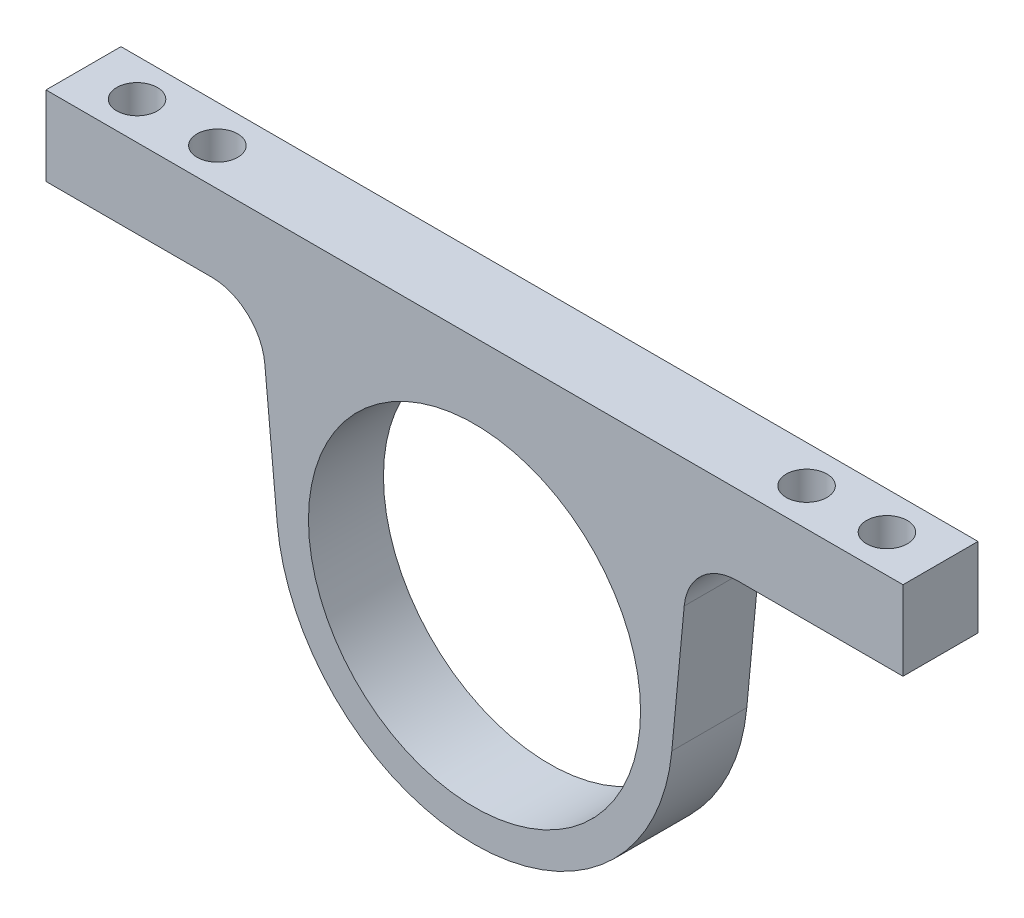
ISO-10303-21;
HEADER;
FILE_DESCRIPTION(('STEP AP214'),'2;1');
FILE_NAME('part.step','',(''),(''),'','','');
FILE_SCHEMA(('AUTOMOTIVE_DESIGN { 1 0 10303 214 1 1 1 1 }'));
ENDSEC;
DATA;
#1=APPLICATION_CONTEXT('core data for automotive mechanical design processes');
#2=APPLICATION_PROTOCOL_DEFINITION('international standard','automotive_design',2000,#1);
#3=PRODUCT_CONTEXT('',#1,'mechanical');
#4=PRODUCT('Part','Part','',(#3));
#5=PRODUCT_RELATED_PRODUCT_CATEGORY('part','',(#4));
#6=PRODUCT_DEFINITION_FORMATION('','',#4);
#7=PRODUCT_DEFINITION_CONTEXT('part definition',#1,'design');
#8=PRODUCT_DEFINITION('design','',#6,#7);
#9=PRODUCT_DEFINITION_SHAPE('','',#8);
#10=(LENGTH_UNIT() NAMED_UNIT(*) SI_UNIT(.MILLI.,.METRE.));
#11=(NAMED_UNIT(*) PLANE_ANGLE_UNIT() SI_UNIT($,.RADIAN.));
#12=(NAMED_UNIT(*) SI_UNIT($,.STERADIAN.) SOLID_ANGLE_UNIT());
#13=UNCERTAINTY_MEASURE_WITH_UNIT(LENGTH_MEASURE(1.E-05),#10,'distance_accuracy_value','');
#14=(GEOMETRIC_REPRESENTATION_CONTEXT(3) GLOBAL_UNCERTAINTY_ASSIGNED_CONTEXT((#13)) GLOBAL_UNIT_ASSIGNED_CONTEXT((#10,
#11,#12)) REPRESENTATION_CONTEXT('',''));
#15=CARTESIAN_POINT('',(0.,0.,0.));
#16=DIRECTION('',(0.,0.,1.));
#17=DIRECTION('',(1.,0.,0.));
#18=AXIS2_PLACEMENT_3D('',#15,#16,#17);
#19=CARTESIAN_POINT('',(-36.8377305404709,-3.46144603130801,7.));
#20=DIRECTION('',(0.995614338931646,0.093552595440757,0.));
#21=DIRECTION('',(-0.093552595440757,0.995614338931646,0.));
#22=AXIS2_PLACEMENT_3D('',#19,#20,#21);
#23=PLANE('',#22);
#24=DIRECTION('',(0.0935525954407569,-0.995614338931646,0.));
#25=VECTOR('',#24,1.);
#26=CARTESIAN_POINT('',(-36.8377305404709,-3.46144603130801,7.));
#27=LINE('',#26,#25);
#28=CARTESIAN_POINT('',(-39.1482594814971,21.1278850648986,7.));
#29=VERTEX_POINT('',#28);
#30=CARTESIAN_POINT('',(-36.8377305404709,-3.46144603130801,7.));
#31=VERTEX_POINT('',#30);
#32=EDGE_CURVE('E122',#29,#31,#27,.T.);
#33=ORIENTED_EDGE('',*,*,#32,.F.);
#34=DIRECTION('',(0.,0.,-1.));
#35=VECTOR('',#34,1.);
#36=CARTESIAN_POINT('',(-39.1482594814971,21.1278850648986,-7.));
#37=LINE('',#36,#35);
#38=CARTESIAN_POINT('',(-39.1482594814971,21.1278850648986,-7.));
#39=VERTEX_POINT('',#38);
#40=EDGE_CURVE('E163',#29,#39,#37,.T.);
#41=ORIENTED_EDGE('',*,*,#40,.T.);
#42=DIRECTION('',(0.0935525954407569,-0.995614338931646,0.));
#43=VECTOR('',#42,1.);
#44=CARTESIAN_POINT('',(-36.8377305404709,-3.46144603130801,-7.));
#45=LINE('',#44,#43);
#46=CARTESIAN_POINT('',(-36.8377305404709,-3.46144603130801,-7.));
#47=VERTEX_POINT('',#46);
#48=EDGE_CURVE('E147',#39,#47,#45,.T.);
#49=ORIENTED_EDGE('',*,*,#48,.T.);
#50=DIRECTION('',(0.,0.,-1.));
#51=VECTOR('',#50,1.);
#52=CARTESIAN_POINT('',(-36.8377305404709,-3.46144603130801,7.));
#53=LINE('',#52,#51);
#54=EDGE_CURVE('E141',#31,#47,#53,.T.);
#55=ORIENTED_EDGE('',*,*,#54,.F.);
#56=EDGE_LOOP('',(#33,#41,#49,#55));
#57=FACE_BOUND('',#56,.T.);
#58=ADVANCED_FACE('F43',(#57),#23,.F.);
#59=CARTESIAN_POINT('',(0.,0.,7.));
#60=DIRECTION('',(0.,0.,-1.));
#61=DIRECTION('',(-1.,0.,0.));
#62=AXIS2_PLACEMENT_3D('',#59,#60,#61);
#63=CYLINDRICAL_SURFACE('',#62,37.);
#64=CARTESIAN_POINT('',(0.,0.,-7.));
#65=DIRECTION('',(0.,0.,1.));
#66=DIRECTION('',(1.,0.,0.));
#67=AXIS2_PLACEMENT_3D('',#64,#65,#66);
#68=CIRCLE('',#67,37.);
#69=CARTESIAN_POINT('',(36.8377305404709,-3.46144603130801,-7.));
#70=VERTEX_POINT('',#69);
#71=EDGE_CURVE('E201',#47,#70,#68,.T.);
#72=ORIENTED_EDGE('',*,*,#71,.T.);
#73=DIRECTION('',(0.,0.,-1.));
#74=VECTOR('',#73,1.);
#75=CARTESIAN_POINT('',(36.8377305404709,-3.46144603130801,7.));
#76=LINE('',#75,#74);
#77=CARTESIAN_POINT('',(36.8377305404709,-3.46144603130801,7.));
#78=VERTEX_POINT('',#77);
#79=EDGE_CURVE('E143',#78,#70,#76,.T.);
#80=ORIENTED_EDGE('',*,*,#79,.F.);
#81=CARTESIAN_POINT('',(0.,0.,7.));
#82=DIRECTION('',(0.,0.,1.));
#83=DIRECTION('',(1.,0.,0.));
#84=AXIS2_PLACEMENT_3D('',#81,#82,#83);
#85=CIRCLE('',#84,37.);
#86=EDGE_CURVE('E127',#31,#78,#85,.T.);
#87=ORIENTED_EDGE('',*,*,#86,.F.);
#88=ORIENTED_EDGE('',*,*,#54,.T.);
#89=EDGE_LOOP('',(#72,#80,#87,#88));
#90=FACE_BOUND('',#89,.T.);
#91=ADVANCED_FACE('F140',(#90),#63,.T.);
#92=CARTESIAN_POINT('',(36.8377305404709,-3.46144603130801,7.));
#93=DIRECTION('',(0.995614338931646,-0.093552595440757,0.));
#94=DIRECTION('',(0.093552595440757,0.995614338931646,0.));
#95=AXIS2_PLACEMENT_3D('',#92,#93,#94);
#96=PLANE('',#95);
#97=DIRECTION('',(-0.0935525954407569,-0.995614338931646,0.));
#98=VECTOR('',#97,1.);
#99=CARTESIAN_POINT('',(36.8377305404709,-3.46144603130801,-7.));
#100=LINE('',#99,#98);
#101=CARTESIAN_POINT('',(39.1482594814971,21.1278850648986,-7.));
#102=VERTEX_POINT('',#101);
#103=EDGE_CURVE('E195',#102,#70,#100,.T.);
#104=ORIENTED_EDGE('',*,*,#103,.F.);
#105=DIRECTION('',(0.,0.,-1.));
#106=VECTOR('',#105,1.);
#107=CARTESIAN_POINT('',(39.1482594814971,21.1278850648986,7.));
#108=LINE('',#107,#106);
#109=CARTESIAN_POINT('',(39.1482594814971,21.1278850648986,7.));
#110=VERTEX_POINT('',#109);
#111=EDGE_CURVE('E155',#102,#110,#108,.F.);
#112=ORIENTED_EDGE('',*,*,#111,.T.);
#113=DIRECTION('',(-0.0935525954407569,-0.995614338931646,0.));
#114=VECTOR('',#113,1.);
#115=CARTESIAN_POINT('',(36.8377305404709,-3.46144603130801,7.));
#116=LINE('',#115,#114);
#117=EDGE_CURVE('E145',#110,#78,#116,.T.);
#118=ORIENTED_EDGE('',*,*,#117,.T.);
#119=ORIENTED_EDGE('',*,*,#79,.T.);
#120=EDGE_LOOP('',(#104,#112,#118,#119));
#121=FACE_BOUND('',#120,.T.);
#122=ADVANCED_FACE('F199',(#121),#96,.T.);
#123=CARTESIAN_POINT('',(0.,30.1923591104911,7.));
#124=DIRECTION('',(0.,-1.,0.));
#125=DIRECTION('',(1.,0.,0.));
#126=AXIS2_PLACEMENT_3D('',#123,#124,#125);
#127=PLANE('',#126);
#128=CARTESIAN_POINT('',(70.,30.1923591104911,0.));
#129=DIRECTION('',(0.,-1.,0.));
#130=DIRECTION('',(1.,0.,0.));
#131=AXIS2_PLACEMENT_3D('',#128,#129,#130);
#132=CIRCLE('',#131,3.8);
#133=CARTESIAN_POINT('',(73.8,30.1923591104911,0.));
#134=VERTEX_POINT('',#133);
#135=EDGE_CURVE('E286',#134,#134,#132,.T.);
#136=ORIENTED_EDGE('',*,*,#135,.F.);
#137=EDGE_LOOP('',(#136));
#138=FACE_BOUND('',#137,.T.);
#139=CARTESIAN_POINT('',(55.,30.1923591104911,0.));
#140=DIRECTION('',(0.,-1.,0.));
#141=DIRECTION('',(1.,0.,0.));
#142=AXIS2_PLACEMENT_3D('',#139,#140,#141);
#143=CIRCLE('',#142,3.8);
#144=CARTESIAN_POINT('',(58.8,30.1923591104911,0.));
#145=VERTEX_POINT('',#144);
#146=EDGE_CURVE('E278',#145,#145,#143,.T.);
#147=ORIENTED_EDGE('',*,*,#146,.F.);
#148=EDGE_LOOP('',(#147));
#149=FACE_BOUND('',#148,.T.);
#150=DIRECTION('',(-1.,0.,0.));
#151=VECTOR('',#150,1.);
#152=CARTESIAN_POINT('',(0.,30.1923591104911,7.));
#153=LINE('',#152,#151);
#154=CARTESIAN_POINT('',(80.,30.1923591104911,7.));
#155=VERTEX_POINT('',#154);
#156=CARTESIAN_POINT('',(49.1044028708136,30.1923591104911,7.));
#157=VERTEX_POINT('',#156);
#158=EDGE_CURVE('E179',#155,#157,#153,.T.);
#159=ORIENTED_EDGE('',*,*,#158,.T.);
#160=DIRECTION('',(0.,0.,-1.));
#161=VECTOR('',#160,1.);
#162=CARTESIAN_POINT('',(49.1044028708136,30.1923591104911,-7.));
#163=LINE('',#162,#161);
#164=CARTESIAN_POINT('',(49.1044028708136,30.1923591104911,-7.));
#165=VERTEX_POINT('',#164);
#166=EDGE_CURVE('E150',#157,#165,#163,.T.);
#167=ORIENTED_EDGE('',*,*,#166,.T.);
#168=DIRECTION('',(-1.,0.,0.));
#169=VECTOR('',#168,1.);
#170=CARTESIAN_POINT('',(0.,30.1923591104911,-7.));
#171=LINE('',#170,#169);
#172=CARTESIAN_POINT('',(80.,30.1923591104911,-7.));
#173=VERTEX_POINT('',#172);
#174=EDGE_CURVE('E197',#173,#165,#171,.T.);
#175=ORIENTED_EDGE('',*,*,#174,.F.);
#176=DIRECTION('',(0.,0.,-1.));
#177=VECTOR('',#176,1.);
#178=CARTESIAN_POINT('',(80.,30.1923591104911,7.));
#179=LINE('',#178,#177);
#180=EDGE_CURVE('E157',#155,#173,#179,.T.);
#181=ORIENTED_EDGE('',*,*,#180,.F.);
#182=EDGE_LOOP('',(#159,#167,#175,#181));
#183=FACE_BOUND('',#182,.T.);
#184=ADVANCED_FACE('F185',(#138,#149,#183),#127,.T.);
#185=CARTESIAN_POINT('',(80.,0.,7.));
#186=DIRECTION('',(1.,0.,0.));
#187=DIRECTION('',(0.,0.,-1.));
#188=AXIS2_PLACEMENT_3D('',#185,#186,#187);
#189=PLANE('',#188);
#190=DIRECTION('',(0.,-1.,0.));
#191=VECTOR('',#190,1.);
#192=CARTESIAN_POINT('',(80.,0.,-7.));
#193=LINE('',#192,#191);
#194=CARTESIAN_POINT('',(80.,45.,-7.));
#195=VERTEX_POINT('',#194);
#196=EDGE_CURVE('E205',#195,#173,#193,.T.);
#197=ORIENTED_EDGE('',*,*,#196,.F.);
#198=DIRECTION('',(0.,0.,-1.));
#199=VECTOR('',#198,1.);
#200=CARTESIAN_POINT('',(80.,45.,7.));
#201=LINE('',#200,#199);
#202=CARTESIAN_POINT('',(80.,45.,7.));
#203=VERTEX_POINT('',#202);
#204=EDGE_CURVE('E233',#203,#195,#201,.T.);
#205=ORIENTED_EDGE('',*,*,#204,.F.);
#206=DIRECTION('',(0.,-1.,0.));
#207=VECTOR('',#206,1.);
#208=CARTESIAN_POINT('',(80.,0.,7.));
#209=LINE('',#208,#207);
#210=EDGE_CURVE('E189',#203,#155,#209,.T.);
#211=ORIENTED_EDGE('',*,*,#210,.T.);
#212=ORIENTED_EDGE('',*,*,#180,.T.);
#213=EDGE_LOOP('',(#197,#205,#211,#212));
#214=FACE_BOUND('',#213,.T.);
#215=ADVANCED_FACE('F238',(#214),#189,.T.);
#216=CARTESIAN_POINT('',(0.,45.,7.));
#217=DIRECTION('',(0.,1.,0.));
#218=DIRECTION('',(0.,0.,1.));
#219=AXIS2_PLACEMENT_3D('',#216,#217,#218);
#220=PLANE('',#219);
#221=CARTESIAN_POINT('',(70.,45.,0.));
#222=DIRECTION('',(0.,1.,0.));
#223=DIRECTION('',(0.,0.,1.));
#224=AXIS2_PLACEMENT_3D('',#221,#222,#223);
#225=CIRCLE('',#224,3.8);
#226=CARTESIAN_POINT('',(70.,45.,3.8));
#227=VERTEX_POINT('',#226);
#228=EDGE_CURVE('E290',#227,#227,#225,.T.);
#229=ORIENTED_EDGE('',*,*,#228,.F.);
#230=EDGE_LOOP('',(#229));
#231=FACE_BOUND('',#230,.T.);
#232=CARTESIAN_POINT('',(55.,45.,0.));
#233=DIRECTION('',(0.,1.,0.));
#234=DIRECTION('',(0.,0.,1.));
#235=AXIS2_PLACEMENT_3D('',#232,#233,#234);
#236=CIRCLE('',#235,3.8);
#237=CARTESIAN_POINT('',(55.,45.,3.8));
#238=VERTEX_POINT('',#237);
#239=EDGE_CURVE('E282',#238,#238,#236,.T.);
#240=ORIENTED_EDGE('',*,*,#239,.F.);
#241=EDGE_LOOP('',(#240));
#242=FACE_BOUND('',#241,.T.);
#243=CARTESIAN_POINT('',(-70.,45.,0.));
#244=DIRECTION('',(0.,1.,0.));
#245=DIRECTION('',(0.,0.,1.));
#246=AXIS2_PLACEMENT_3D('',#243,#244,#245);
#247=CIRCLE('',#246,3.8);
#248=CARTESIAN_POINT('',(-70.,45.,3.8));
#249=VERTEX_POINT('',#248);
#250=EDGE_CURVE('E274',#249,#249,#247,.T.);
#251=ORIENTED_EDGE('',*,*,#250,.F.);
#252=EDGE_LOOP('',(#251));
#253=FACE_BOUND('',#252,.T.);
#254=CARTESIAN_POINT('',(-55.,45.,0.));
#255=DIRECTION('',(0.,1.,0.));
#256=DIRECTION('',(0.,0.,1.));
#257=AXIS2_PLACEMENT_3D('',#254,#255,#256);
#258=CIRCLE('',#257,3.8);
#259=CARTESIAN_POINT('',(-55.,45.,3.8));
#260=VERTEX_POINT('',#259);
#261=EDGE_CURVE('E265',#260,#260,#258,.T.);
#262=ORIENTED_EDGE('',*,*,#261,.F.);
#263=EDGE_LOOP('',(#262));
#264=FACE_BOUND('',#263,.T.);
#265=DIRECTION('',(1.,0.,0.));
#266=VECTOR('',#265,1.);
#267=CARTESIAN_POINT('',(0.,45.,-7.));
#268=LINE('',#267,#266);
#269=CARTESIAN_POINT('',(-80.,45.,-7.));
#270=VERTEX_POINT('',#269);
#271=EDGE_CURVE('E212',#270,#195,#268,.T.);
#272=ORIENTED_EDGE('',*,*,#271,.F.);
#273=DIRECTION('',(0.,0.,-1.));
#274=VECTOR('',#273,1.);
#275=CARTESIAN_POINT('',(-80.,45.,7.));
#276=LINE('',#275,#274);
#277=CARTESIAN_POINT('',(-80.,45.,7.));
#278=VERTEX_POINT('',#277);
#279=EDGE_CURVE('E229',#278,#270,#276,.T.);
#280=ORIENTED_EDGE('',*,*,#279,.F.);
#281=DIRECTION('',(1.,0.,0.));
#282=VECTOR('',#281,1.);
#283=CARTESIAN_POINT('',(0.,45.,7.));
#284=LINE('',#283,#282);
#285=EDGE_CURVE('E246',#278,#203,#284,.T.);
#286=ORIENTED_EDGE('',*,*,#285,.T.);
#287=ORIENTED_EDGE('',*,*,#204,.T.);
#288=EDGE_LOOP('',(#272,#280,#286,#287));
#289=FACE_BOUND('',#288,.T.);
#290=ADVANCED_FACE('F242',(#231,#242,#253,#264,#289),#220,.T.);
#291=CARTESIAN_POINT('',(-80.,0.,7.));
#292=DIRECTION('',(1.,0.,0.));
#293=DIRECTION('',(0.,0.,-1.));
#294=AXIS2_PLACEMENT_3D('',#291,#292,#293);
#295=PLANE('',#294);
#296=DIRECTION('',(0.,-1.,0.));
#297=VECTOR('',#296,1.);
#298=CARTESIAN_POINT('',(-80.,0.,-7.));
#299=LINE('',#298,#297);
#300=CARTESIAN_POINT('',(-80.,30.1923591104911,-7.));
#301=VERTEX_POINT('',#300);
#302=EDGE_CURVE('E216',#270,#301,#299,.T.);
#303=ORIENTED_EDGE('',*,*,#302,.T.);
#304=DIRECTION('',(0.,0.,-1.));
#305=VECTOR('',#304,1.);
#306=CARTESIAN_POINT('',(-80.,30.1923591104911,7.));
#307=LINE('',#306,#305);
#308=CARTESIAN_POINT('',(-80.,30.1923591104911,7.));
#309=VERTEX_POINT('',#308);
#310=EDGE_CURVE('E225',#309,#301,#307,.T.);
#311=ORIENTED_EDGE('',*,*,#310,.F.);
#312=DIRECTION('',(0.,-1.,0.));
#313=VECTOR('',#312,1.);
#314=CARTESIAN_POINT('',(-80.,0.,7.));
#315=LINE('',#314,#313);
#316=EDGE_CURVE('E250',#278,#309,#315,.T.);
#317=ORIENTED_EDGE('',*,*,#316,.F.);
#318=ORIENTED_EDGE('',*,*,#279,.T.);
#319=EDGE_LOOP('',(#303,#311,#317,#318));
#320=FACE_BOUND('',#319,.T.);
#321=ADVANCED_FACE('F299',(#320),#295,.F.);
#322=CARTESIAN_POINT('',(0.,30.1923591104911,7.));
#323=DIRECTION('',(0.,1.,0.));
#324=DIRECTION('',(-1.,0.,0.));
#325=AXIS2_PLACEMENT_3D('',#322,#323,#324);
#326=PLANE('',#325);
#327=CARTESIAN_POINT('',(-70.,30.1923591104911,0.));
#328=DIRECTION('',(0.,1.,0.));
#329=DIRECTION('',(-1.,0.,0.));
#330=AXIS2_PLACEMENT_3D('',#327,#328,#329);
#331=CIRCLE('',#330,3.8);
#332=CARTESIAN_POINT('',(-73.8,30.1923591104911,0.));
#333=VERTEX_POINT('',#332);
#334=EDGE_CURVE('E47',#333,#333,#331,.T.);
#335=ORIENTED_EDGE('',*,*,#334,.T.);
#336=EDGE_LOOP('',(#335));
#337=FACE_BOUND('',#336,.T.);
#338=CARTESIAN_POINT('',(-55.,30.1923591104911,0.));
#339=DIRECTION('',(0.,1.,0.));
#340=DIRECTION('',(-1.,0.,0.));
#341=AXIS2_PLACEMENT_3D('',#338,#339,#340);
#342=CIRCLE('',#341,3.8);
#343=CARTESIAN_POINT('',(-58.8,30.1923591104911,0.));
#344=VERTEX_POINT('',#343);
#345=EDGE_CURVE('E262',#344,#344,#342,.T.);
#346=ORIENTED_EDGE('',*,*,#345,.T.);
#347=EDGE_LOOP('',(#346));
#348=FACE_BOUND('',#347,.T.);
#349=DIRECTION('',(1.,0.,0.));
#350=VECTOR('',#349,1.);
#351=CARTESIAN_POINT('',(0.,30.1923591104911,-7.));
#352=LINE('',#351,#350);
#353=CARTESIAN_POINT('',(-49.1044028708136,30.1923591104911,-7.));
#354=VERTEX_POINT('',#353);
#355=EDGE_CURVE('E219',#301,#354,#352,.T.);
#356=ORIENTED_EDGE('',*,*,#355,.T.);
#357=DIRECTION('',(0.,0.,-1.));
#358=VECTOR('',#357,1.);
#359=CARTESIAN_POINT('',(-49.1044028708136,30.1923591104911,7.));
#360=LINE('',#359,#358);
#361=CARTESIAN_POINT('',(-49.1044028708136,30.1923591104911,7.));
#362=VERTEX_POINT('',#361);
#363=EDGE_CURVE('E60',#354,#362,#360,.F.);
#364=ORIENTED_EDGE('',*,*,#363,.T.);
#365=DIRECTION('',(1.,0.,0.));
#366=VECTOR('',#365,1.);
#367=CARTESIAN_POINT('',(0.,30.1923591104911,7.));
#368=LINE('',#367,#366);
#369=EDGE_CURVE('E256',#309,#362,#368,.T.);
#370=ORIENTED_EDGE('',*,*,#369,.F.);
#371=ORIENTED_EDGE('',*,*,#310,.T.);
#372=EDGE_LOOP('',(#356,#364,#370,#371));
#373=FACE_BOUND('',#372,.T.);
#374=ADVANCED_FACE('F340',(#337,#348,#373),#326,.F.);
#375=CARTESIAN_POINT('',(0.,0.,7.));
#376=DIRECTION('',(0.,0.,-1.));
#377=DIRECTION('',(-1.,0.,0.));
#378=AXIS2_PLACEMENT_3D('',#375,#376,#377);
#379=CYLINDRICAL_SURFACE('',#378,31.);
#380=CARTESIAN_POINT('',(0.,0.,7.));
#381=DIRECTION('',(0.,0.,1.));
#382=DIRECTION('',(1.,0.,0.));
#383=AXIS2_PLACEMENT_3D('',#380,#381,#382);
#384=CIRCLE('',#383,31.);
#385=CARTESIAN_POINT('',(31.,0.,7.));
#386=VERTEX_POINT('',#385);
#387=EDGE_CURVE('E230',#386,#386,#384,.T.);
#388=ORIENTED_EDGE('',*,*,#387,.T.);
#389=EDGE_LOOP('',(#388));
#390=FACE_BOUND('',#389,.T.);
#391=CARTESIAN_POINT('',(0.,0.,-7.));
#392=DIRECTION('',(0.,0.,1.));
#393=DIRECTION('',(1.,0.,0.));
#394=AXIS2_PLACEMENT_3D('',#391,#392,#393);
#395=CIRCLE('',#394,31.);
#396=CARTESIAN_POINT('',(31.,0.,-7.));
#397=VERTEX_POINT('',#396);
#398=EDGE_CURVE('E135',#397,#397,#395,.T.);
#399=ORIENTED_EDGE('',*,*,#398,.F.);
#400=EDGE_LOOP('',(#399));
#401=FACE_BOUND('',#400,.T.);
#402=ADVANCED_FACE('F336',(#390,#401),#379,.F.);
#403=CARTESIAN_POINT('',(0.,0.,7.));
#404=DIRECTION('',(0.,0.,1.));
#405=DIRECTION('',(1.,0.,0.));
#406=AXIS2_PLACEMENT_3D('',#403,#404,#405);
#407=PLANE('',#406);
#408=ORIENTED_EDGE('',*,*,#369,.T.);
#409=CARTESIAN_POINT('',(-49.1044028708136,20.1923591104911,7.));
#410=DIRECTION('',(0.,0.,1.));
#411=DIRECTION('',(1.,0.,0.));
#412=AXIS2_PLACEMENT_3D('',#409,#410,#411);
#413=CIRCLE('',#412,10.);
#414=EDGE_CURVE('E11',#362,#29,#413,.F.);
#415=ORIENTED_EDGE('',*,*,#414,.T.);
#416=ORIENTED_EDGE('',*,*,#32,.T.);
#417=ORIENTED_EDGE('',*,*,#86,.T.);
#418=ORIENTED_EDGE('',*,*,#117,.F.);
#419=CARTESIAN_POINT('',(49.1044028708136,20.1923591104911,7.));
#420=DIRECTION('',(0.,0.,1.));
#421=DIRECTION('',(1.,0.,0.));
#422=AXIS2_PLACEMENT_3D('',#419,#420,#421);
#423=CIRCLE('',#422,10.);
#424=EDGE_CURVE('E171',#110,#157,#423,.F.);
#425=ORIENTED_EDGE('',*,*,#424,.T.);
#426=ORIENTED_EDGE('',*,*,#158,.F.);
#427=ORIENTED_EDGE('',*,*,#210,.F.);
#428=ORIENTED_EDGE('',*,*,#285,.F.);
#429=ORIENTED_EDGE('',*,*,#316,.T.);
#430=EDGE_LOOP('',(#408,#415,#416,#417,#418,#425,#426,#427,#428,#429));
#431=FACE_BOUND('',#430,.T.);
#432=ORIENTED_EDGE('',*,*,#387,.F.);
#433=EDGE_LOOP('',(#432));
#434=FACE_BOUND('',#433,.T.);
#435=ADVANCED_FACE('F124',(#431,#434),#407,.T.);
#436=CARTESIAN_POINT('',(0.,0.,-7.));
#437=DIRECTION('',(0.,0.,1.));
#438=DIRECTION('',(1.,0.,0.));
#439=AXIS2_PLACEMENT_3D('',#436,#437,#438);
#440=PLANE('',#439);
#441=ORIENTED_EDGE('',*,*,#48,.F.);
#442=CARTESIAN_POINT('',(-49.1044028708136,20.1923591104911,-7.));
#443=DIRECTION('',(0.,0.,1.));
#444=DIRECTION('',(1.,0.,0.));
#445=AXIS2_PLACEMENT_3D('',#442,#443,#444);
#446=CIRCLE('',#445,10.);
#447=EDGE_CURVE('E53',#39,#354,#446,.T.);
#448=ORIENTED_EDGE('',*,*,#447,.T.);
#449=ORIENTED_EDGE('',*,*,#355,.F.);
#450=ORIENTED_EDGE('',*,*,#302,.F.);
#451=ORIENTED_EDGE('',*,*,#271,.T.);
#452=ORIENTED_EDGE('',*,*,#196,.T.);
#453=ORIENTED_EDGE('',*,*,#174,.T.);
#454=CARTESIAN_POINT('',(49.1044028708136,20.1923591104911,-7.));
#455=DIRECTION('',(0.,0.,1.));
#456=DIRECTION('',(1.,0.,0.));
#457=AXIS2_PLACEMENT_3D('',#454,#455,#456);
#458=CIRCLE('',#457,10.);
#459=EDGE_CURVE('E168',#165,#102,#458,.T.);
#460=ORIENTED_EDGE('',*,*,#459,.T.);
#461=ORIENTED_EDGE('',*,*,#103,.T.);
#462=ORIENTED_EDGE('',*,*,#71,.F.);
#463=EDGE_LOOP('',(#441,#448,#449,#450,#451,#452,#453,#460,#461,#462));
#464=FACE_BOUND('',#463,.T.);
#465=ORIENTED_EDGE('',*,*,#398,.T.);
#466=EDGE_LOOP('',(#465));
#467=FACE_BOUND('',#466,.T.);
#468=ADVANCED_FACE('F193',(#464,#467),#440,.F.);
#469=CARTESIAN_POINT('',(49.1044028708136,20.1923591104911,7.));
#470=DIRECTION('',(0.,0.,1.));
#471=DIRECTION('',(1.,0.,0.));
#472=AXIS2_PLACEMENT_3D('',#469,#470,#471);
#473=CYLINDRICAL_SURFACE('',#472,10.);
#474=ORIENTED_EDGE('',*,*,#424,.F.);
#475=ORIENTED_EDGE('',*,*,#111,.F.);
#476=ORIENTED_EDGE('',*,*,#459,.F.);
#477=ORIENTED_EDGE('',*,*,#166,.F.);
#478=EDGE_LOOP('',(#474,#475,#476,#477));
#479=FACE_BOUND('',#478,.T.);
#480=ADVANCED_FACE('F191',(#479),#473,.F.);
#481=CARTESIAN_POINT('',(-49.1044028708136,20.1923591104911,7.));
#482=DIRECTION('',(0.,0.,1.));
#483=DIRECTION('',(1.,0.,0.));
#484=AXIS2_PLACEMENT_3D('',#481,#482,#483);
#485=CYLINDRICAL_SURFACE('',#484,10.);
#486=ORIENTED_EDGE('',*,*,#414,.F.);
#487=ORIENTED_EDGE('',*,*,#363,.F.);
#488=ORIENTED_EDGE('',*,*,#447,.F.);
#489=ORIENTED_EDGE('',*,*,#40,.F.);
#490=EDGE_LOOP('',(#486,#487,#488,#489));
#491=FACE_BOUND('',#490,.T.);
#492=ADVANCED_FACE('F45',(#491),#485,.F.);
#493=CARTESIAN_POINT('',(-55.,45.,0.));
#494=DIRECTION('',(0.,1.,0.));
#495=DIRECTION('',(0.,0.,1.));
#496=AXIS2_PLACEMENT_3D('',#493,#494,#495);
#497=CYLINDRICAL_SURFACE('',#496,3.8);
#498=ORIENTED_EDGE('',*,*,#261,.T.);
#499=EDGE_LOOP('',(#498));
#500=FACE_BOUND('',#499,.T.);
#501=ORIENTED_EDGE('',*,*,#345,.F.);
#502=EDGE_LOOP('',(#501));
#503=FACE_BOUND('',#502,.T.);
#504=ADVANCED_FACE('F307',(#500,#503),#497,.F.);
#505=CARTESIAN_POINT('',(-70.,45.,0.));
#506=DIRECTION('',(0.,1.,0.));
#507=DIRECTION('',(0.,0.,1.));
#508=AXIS2_PLACEMENT_3D('',#505,#506,#507);
#509=CYLINDRICAL_SURFACE('',#508,3.8);
#510=ORIENTED_EDGE('',*,*,#250,.T.);
#511=EDGE_LOOP('',(#510));
#512=FACE_BOUND('',#511,.T.);
#513=ORIENTED_EDGE('',*,*,#334,.F.);
#514=EDGE_LOOP('',(#513));
#515=FACE_BOUND('',#514,.T.);
#516=ADVANCED_FACE('F310',(#512,#515),#509,.F.);
#517=CARTESIAN_POINT('',(55.,45.,0.));
#518=DIRECTION('',(0.,1.,0.));
#519=DIRECTION('',(0.,0.,1.));
#520=AXIS2_PLACEMENT_3D('',#517,#518,#519);
#521=CYLINDRICAL_SURFACE('',#520,3.8);
#522=ORIENTED_EDGE('',*,*,#146,.T.);
#523=EDGE_LOOP('',(#522));
#524=FACE_BOUND('',#523,.T.);
#525=ORIENTED_EDGE('',*,*,#239,.T.);
#526=EDGE_LOOP('',(#525));
#527=FACE_BOUND('',#526,.T.);
#528=ADVANCED_FACE('F316',(#524,#527),#521,.F.);
#529=CARTESIAN_POINT('',(70.,45.,0.));
#530=DIRECTION('',(0.,1.,0.));
#531=DIRECTION('',(0.,0.,1.));
#532=AXIS2_PLACEMENT_3D('',#529,#530,#531);
#533=CYLINDRICAL_SURFACE('',#532,3.8);
#534=ORIENTED_EDGE('',*,*,#135,.T.);
#535=EDGE_LOOP('',(#534));
#536=FACE_BOUND('',#535,.T.);
#537=ORIENTED_EDGE('',*,*,#228,.T.);
#538=EDGE_LOOP('',(#537));
#539=FACE_BOUND('',#538,.T.);
#540=ADVANCED_FACE('F295',(#536,#539),#533,.F.);
#541=CLOSED_SHELL('',(#58,#91,#122,#184,#215,#290,#321,#374,#402,#435,#468,#480,#492,#504,#516,
#528,#540));
#542=MANIFOLD_SOLID_BREP('B2',#541);
#543=ADVANCED_BREP_SHAPE_REPRESENTATION('',(#18,#542),#14);
#544=SHAPE_DEFINITION_REPRESENTATION(#9,#543);
ENDSEC;
END-ISO-10303-21;
